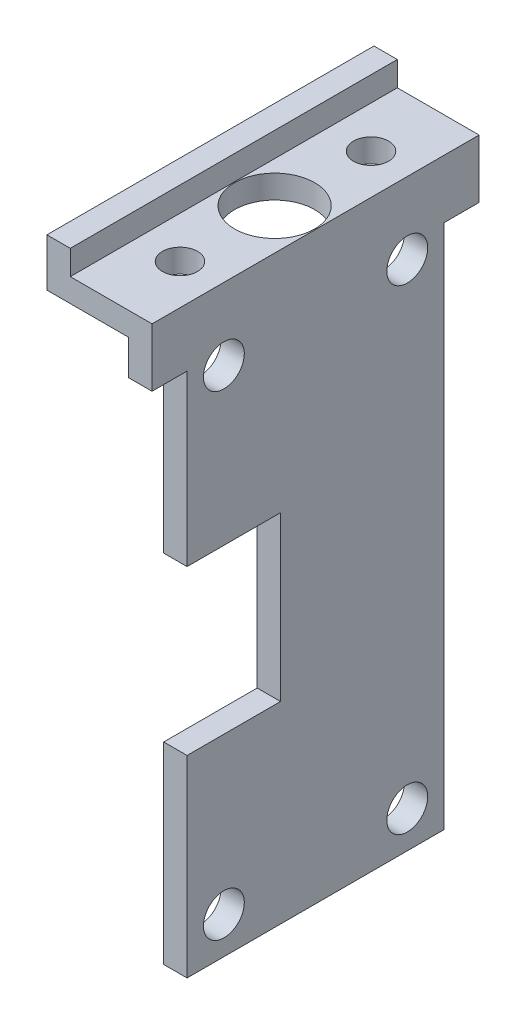
ISO-10303-21;
HEADER;
FILE_DESCRIPTION(('STEP AP214'),'2;1');
FILE_NAME('part.step','',(''),(''),'','','');
FILE_SCHEMA(('AUTOMOTIVE_DESIGN { 1 0 10303 214 1 1 1 1 }'));
ENDSEC;
DATA;
#1=APPLICATION_CONTEXT('core data for automotive mechanical design processes');
#2=APPLICATION_PROTOCOL_DEFINITION('international standard','automotive_design',2000,#1);
#3=PRODUCT_CONTEXT('',#1,'mechanical');
#4=PRODUCT('Part','Part','',(#3));
#5=PRODUCT_RELATED_PRODUCT_CATEGORY('part','',(#4));
#6=PRODUCT_DEFINITION_FORMATION('','',#4);
#7=PRODUCT_DEFINITION_CONTEXT('part definition',#1,'design');
#8=PRODUCT_DEFINITION('design','',#6,#7);
#9=PRODUCT_DEFINITION_SHAPE('','',#8);
#10=(LENGTH_UNIT() NAMED_UNIT(*) SI_UNIT(.MILLI.,.METRE.));
#11=(NAMED_UNIT(*) PLANE_ANGLE_UNIT() SI_UNIT($,.RADIAN.));
#12=(NAMED_UNIT(*) SI_UNIT($,.STERADIAN.) SOLID_ANGLE_UNIT());
#13=UNCERTAINTY_MEASURE_WITH_UNIT(LENGTH_MEASURE(1.E-05),#10,'distance_accuracy_value','');
#14=(GEOMETRIC_REPRESENTATION_CONTEXT(3) GLOBAL_UNCERTAINTY_ASSIGNED_CONTEXT((#13)) GLOBAL_UNIT_ASSIGNED_CONTEXT((#10,
#11,#12)) REPRESENTATION_CONTEXT('',''));
#15=CARTESIAN_POINT('',(0.,0.,0.));
#16=DIRECTION('',(0.,0.,1.));
#17=DIRECTION('',(1.,0.,0.));
#18=AXIS2_PLACEMENT_3D('',#15,#16,#17);
#19=CARTESIAN_POINT('',(-9.95317530410806,-0.412499999999998,25.));
#20=DIRECTION('',(0.,0.,-1.));
#21=DIRECTION('',(0.,1.,0.));
#22=AXIS2_PLACEMENT_3D('',#19,#20,#21);
#23=PLANE('',#22);
#24=DIRECTION('',(0.,1.,0.));
#25=VECTOR('',#24,1.);
#26=CARTESIAN_POINT('',(-9.95317530410806,-0.412499999999998,25.));
#27=LINE('',#26,#25);
#28=CARTESIAN_POINT('',(-9.95317530410806,-14.9125,25.));
#29=VERTEX_POINT('',#28);
#30=CARTESIAN_POINT('',(-9.95317530410806,-0.412499999999998,25.));
#31=VERTEX_POINT('',#30);
#32=EDGE_CURVE('E188',#29,#31,#27,.T.);
#33=ORIENTED_EDGE('',*,*,#32,.F.);
#34=DIRECTION('',(1.,0.,0.));
#35=VECTOR('',#34,1.);
#36=CARTESIAN_POINT('',(-9.95317530410806,-14.9125,25.));
#37=LINE('',#36,#35);
#38=CARTESIAN_POINT('',(-7.95317530410806,-14.9125,25.));
#39=VERTEX_POINT('',#38);
#40=EDGE_CURVE('E11',#29,#39,#37,.T.);
#41=ORIENTED_EDGE('',*,*,#40,.T.);
#42=DIRECTION('',(0.,1.,0.));
#43=VECTOR('',#42,1.);
#44=CARTESIAN_POINT('',(-7.95317530410806,-0.412499999999998,25.));
#45=LINE('',#44,#43);
#46=CARTESIAN_POINT('',(-7.95317530410806,-0.412499999999998,25.));
#47=VERTEX_POINT('',#46);
#48=EDGE_CURVE('E186',#39,#47,#45,.T.);
#49=ORIENTED_EDGE('',*,*,#48,.T.);
#50=DIRECTION('',(1.,0.,0.));
#51=VECTOR('',#50,1.);
#52=CARTESIAN_POINT('',(-9.95317530410806,-0.412499999999998,25.));
#53=LINE('',#52,#51);
#54=EDGE_CURVE('E199',#31,#47,#53,.T.);
#55=ORIENTED_EDGE('',*,*,#54,.F.);
#56=EDGE_LOOP('',(#33,#41,#49,#55));
#57=FACE_BOUND('',#56,.T.);
#58=ADVANCED_FACE('F33',(#57),#23,.F.);
#59=CARTESIAN_POINT('',(-16.9531753041081,2.5875,28.));
#60=DIRECTION('',(1.,0.,0.));
#61=DIRECTION('',(0.,0.,-1.));
#62=AXIS2_PLACEMENT_3D('',#59,#60,#61);
#63=PLANE('',#62);
#64=DIRECTION('',(0.,-1.,0.));
#65=VECTOR('',#64,1.);
#66=CARTESIAN_POINT('',(-16.9531753041081,2.5875,0.));
#67=LINE('',#66,#65);
#68=CARTESIAN_POINT('',(-16.9531753041081,6.6875,0.));
#69=VERTEX_POINT('',#68);
#70=CARTESIAN_POINT('',(-16.9531753041081,2.5875,0.));
#71=VERTEX_POINT('',#70);
#72=EDGE_CURVE('E217',#69,#71,#67,.T.);
#73=ORIENTED_EDGE('',*,*,#72,.T.);
#74=DIRECTION('',(0.,0.,-1.));
#75=VECTOR('',#74,1.);
#76=CARTESIAN_POINT('',(-16.9531753041081,2.5875,28.));
#77=LINE('',#76,#75);
#78=CARTESIAN_POINT('',(-16.9531753041081,2.5875,28.));
#79=VERTEX_POINT('',#78);
#80=EDGE_CURVE('E170',#79,#71,#77,.T.);
#81=ORIENTED_EDGE('',*,*,#80,.F.);
#82=DIRECTION('',(0.,-1.,0.));
#83=VECTOR('',#82,1.);
#84=CARTESIAN_POINT('',(-16.9531753041081,2.5875,28.));
#85=LINE('',#84,#83);
#86=CARTESIAN_POINT('',(-16.9531753041081,6.6875,28.));
#87=VERTEX_POINT('',#86);
#88=EDGE_CURVE('E221',#87,#79,#85,.T.);
#89=ORIENTED_EDGE('',*,*,#88,.F.);
#90=DIRECTION('',(0.,0.,-1.));
#91=VECTOR('',#90,1.);
#92=CARTESIAN_POINT('',(-16.9531753041081,6.6875,28.));
#93=LINE('',#92,#91);
#94=EDGE_CURVE('E238',#87,#69,#93,.T.);
#95=ORIENTED_EDGE('',*,*,#94,.T.);
#96=EDGE_LOOP('',(#73,#81,#89,#95));
#97=FACE_BOUND('',#96,.T.);
#98=ADVANCED_FACE('F35',(#97),#63,.F.);
#99=CARTESIAN_POINT('',(-9.95317530410806,2.5875,28.));
#100=DIRECTION('',(0.,1.,0.));
#101=DIRECTION('',(-1.,0.,0.));
#102=AXIS2_PLACEMENT_3D('',#99,#100,#101);
#103=PLANE('',#102);
#104=DIRECTION('',(0.,0.,-1.));
#105=VECTOR('',#104,1.);
#106=CARTESIAN_POINT('',(-9.95317530410806,2.5875,28.));
#107=LINE('',#106,#105);
#108=CARTESIAN_POINT('',(-9.95317530410806,2.5875,21.724774126454));
#109=VERTEX_POINT('',#108);
#110=CARTESIAN_POINT('',(-9.95317530410806,2.5875,17.0820654773948));
#111=VERTEX_POINT('',#110);
#112=EDGE_CURVE('E275',#109,#111,#107,.T.);
#113=ORIENTED_EDGE('',*,*,#112,.F.);
#114=CARTESIAN_POINT('',(-11.3831753041081,2.5875,22.1776538014229));
#115=DIRECTION('',(0.,1.,0.));
#116=DIRECTION('',(0.,0.,1.));
#117=AXIS2_PLACEMENT_3D('',#114,#115,#116);
#118=CIRCLE('',#117,1.5);
#119=CARTESIAN_POINT('',(-9.95317530410806,2.5875,22.6305334763919));
#120=VERTEX_POINT('',#119);
#121=EDGE_CURVE('E206',#109,#120,#118,.T.);
#122=ORIENTED_EDGE('',*,*,#121,.T.);
#123=CARTESIAN_POINT('',(-9.95317530410806,2.5875,28.));
#124=VERTEX_POINT('',#123);
#125=EDGE_CURVE('E271',#124,#120,#107,.T.);
#126=ORIENTED_EDGE('',*,*,#125,.F.);
#127=DIRECTION('',(1.,0.,0.));
#128=VECTOR('',#127,1.);
#129=CARTESIAN_POINT('',(-9.95317530410806,2.5875,28.));
#130=LINE('',#129,#128);
#131=EDGE_CURVE('E224',#79,#124,#130,.T.);
#132=ORIENTED_EDGE('',*,*,#131,.F.);
#133=ORIENTED_EDGE('',*,*,#80,.T.);
#134=DIRECTION('',(1.,0.,0.));
#135=VECTOR('',#134,1.);
#136=CARTESIAN_POINT('',(-9.95317530410806,2.5875,0.));
#137=LINE('',#136,#135);
#138=CARTESIAN_POINT('',(-9.95317530410806,2.5875,0.));
#139=VERTEX_POINT('',#138);
#140=EDGE_CURVE('E241',#71,#139,#137,.T.);
#141=ORIENTED_EDGE('',*,*,#140,.T.);
#142=CARTESIAN_POINT('',(-9.95317530410806,2.5875,5.36912032503104));
#143=VERTEX_POINT('',#142);
#144=EDGE_CURVE('E270',#143,#139,#107,.T.);
#145=ORIENTED_EDGE('',*,*,#144,.F.);
#146=CARTESIAN_POINT('',(-11.3831753041081,2.5875,5.822));
#147=DIRECTION('',(0.,1.,0.));
#148=DIRECTION('',(0.,0.,1.));
#149=AXIS2_PLACEMENT_3D('',#146,#147,#148);
#150=CIRCLE('',#149,1.5);
#151=CARTESIAN_POINT('',(-9.95317530410806,2.5875,6.27487967496896));
#152=VERTEX_POINT('',#151);
#153=EDGE_CURVE('E212',#143,#152,#150,.T.);
#154=ORIENTED_EDGE('',*,*,#153,.T.);
#155=CARTESIAN_POINT('',(-9.95317530410806,2.5875,10.9179345226052));
#156=VERTEX_POINT('',#155);
#157=EDGE_CURVE('E303',#156,#152,#107,.T.);
#158=ORIENTED_EDGE('',*,*,#157,.F.);
#159=CARTESIAN_POINT('',(-11.4584235869674,2.5875,14.));
#160=DIRECTION('',(0.,1.,0.));
#161=DIRECTION('',(0.,0.,1.));
#162=AXIS2_PLACEMENT_3D('',#159,#160,#161);
#163=CIRCLE('',#162,3.43);
#164=EDGE_CURVE('E218',#156,#111,#163,.T.);
#165=ORIENTED_EDGE('',*,*,#164,.T.);
#166=EDGE_LOOP('',(#113,#122,#126,#132,#133,#141,#145,#154,#158,#165));
#167=FACE_BOUND('',#166,.T.);
#168=ADVANCED_FACE('F281',(#167),#103,.F.);
#169=CARTESIAN_POINT('',(-9.95317530410805,-45.4125,28.));
#170=DIRECTION('',(1.,0.,0.));
#171=DIRECTION('',(0.,1.,0.));
#172=AXIS2_PLACEMENT_3D('',#169,#170,#171);
#173=PLANE('',#172);
#174=CARTESIAN_POINT('',(-9.95317530410806,-1.5625,21.8499999999998));
#175=DIRECTION('',(-1.,0.,0.));
#176=DIRECTION('',(0.,-1.,0.));
#177=AXIS2_PLACEMENT_3D('',#174,#175,#176);
#178=CIRCLE('',#177,1.75000000000063);
#179=CARTESIAN_POINT('',(-9.95317530410806,-3.31250000000063,21.8499999999998));
#180=VERTEX_POINT('',#179);
#181=EDGE_CURVE('E401',#180,#180,#178,.T.);
#182=ORIENTED_EDGE('',*,*,#181,.F.);
#183=EDGE_LOOP('',(#182));
#184=FACE_BOUND('',#183,.T.);
#185=CARTESIAN_POINT('',(-9.95317530410806,-1.5625,6.14999999999979));
#186=DIRECTION('',(-1.,0.,0.));
#187=DIRECTION('',(0.,-1.,0.));
#188=AXIS2_PLACEMENT_3D('',#185,#186,#187);
#189=CIRCLE('',#188,1.75000000000063);
#190=CARTESIAN_POINT('',(-9.95317530410806,-3.31250000000063,6.14999999999979));
#191=VERTEX_POINT('',#190);
#192=EDGE_CURVE('E405',#191,#191,#189,.T.);
#193=ORIENTED_EDGE('',*,*,#192,.F.);
#194=EDGE_LOOP('',(#193));
#195=FACE_BOUND('',#194,.T.);
#196=CARTESIAN_POINT('',(-9.95317530410805,-42.2625,6.15000000000001));
#197=DIRECTION('',(-1.,0.,0.));
#198=DIRECTION('',(0.,-1.,0.));
#199=AXIS2_PLACEMENT_3D('',#196,#197,#198);
#200=CIRCLE('',#199,1.75);
#201=CARTESIAN_POINT('',(-9.95317530410805,-44.0125,6.15000000000001));
#202=VERTEX_POINT('',#201);
#203=EDGE_CURVE('E411',#202,#202,#200,.T.);
#204=ORIENTED_EDGE('',*,*,#203,.F.);
#205=EDGE_LOOP('',(#204));
#206=FACE_BOUND('',#205,.T.);
#207=CARTESIAN_POINT('',(-9.95317530410805,-42.2625,21.85));
#208=DIRECTION('',(-1.,0.,0.));
#209=DIRECTION('',(0.,-1.,0.));
#210=AXIS2_PLACEMENT_3D('',#207,#208,#209);
#211=CIRCLE('',#210,1.75);
#212=CARTESIAN_POINT('',(-9.95317530410805,-44.0125,21.85));
#213=VERTEX_POINT('',#212);
#214=EDGE_CURVE('E417',#213,#213,#211,.T.);
#215=ORIENTED_EDGE('',*,*,#214,.F.);
#216=EDGE_LOOP('',(#215));
#217=FACE_BOUND('',#216,.T.);
#218=DIRECTION('',(0.,1.,0.));
#219=VECTOR('',#218,1.);
#220=CARTESIAN_POINT('',(-9.95317530410805,-45.4125,17.0000000000006));
#221=LINE('',#220,#219);
#222=CARTESIAN_POINT('',(-9.95317530410805,-28.9124999999999,17.0000000000006));
#223=VERTEX_POINT('',#222);
#224=CARTESIAN_POINT('',(-9.95317530410805,-14.9124999999999,17.0000000000006));
#225=VERTEX_POINT('',#224);
#226=EDGE_CURVE('E399',#223,#225,#221,.T.);
#227=ORIENTED_EDGE('',*,*,#226,.T.);
#228=DIRECTION('',(0.,0.,1.));
#229=VECTOR('',#228,1.);
#230=CARTESIAN_POINT('',(-9.95317530410805,-14.9125,28.0000000000002));
#231=LINE('',#230,#229);
#232=EDGE_CURVE('E389',#225,#29,#231,.T.);
#233=ORIENTED_EDGE('',*,*,#232,.T.);
#234=ORIENTED_EDGE('',*,*,#32,.T.);
#235=DIRECTION('',(0.,0.,1.));
#236=VECTOR('',#235,1.);
#237=CARTESIAN_POINT('',(-9.95317530410806,-0.412499999999998,28.));
#238=LINE('',#237,#236);
#239=CARTESIAN_POINT('',(-9.95317530410806,-0.412499999999998,28.));
#240=VERTEX_POINT('',#239);
#241=EDGE_CURVE('E192',#31,#240,#238,.T.);
#242=ORIENTED_EDGE('',*,*,#241,.T.);
#243=DIRECTION('',(0.,-1.,0.));
#244=VECTOR('',#243,1.);
#245=CARTESIAN_POINT('',(-9.95317530410805,-45.4125,28.));
#246=LINE('',#245,#244);
#247=EDGE_CURVE('E227',#124,#240,#246,.T.);
#248=ORIENTED_EDGE('',*,*,#247,.F.);
#249=ORIENTED_EDGE('',*,*,#125,.T.);
#250=EDGE_CURVE('E274',#120,#109,#107,.T.);
#251=ORIENTED_EDGE('',*,*,#250,.T.);
#252=ORIENTED_EDGE('',*,*,#112,.T.);
#253=EDGE_CURVE('E276',#111,#156,#107,.T.);
#254=ORIENTED_EDGE('',*,*,#253,.T.);
#255=ORIENTED_EDGE('',*,*,#157,.T.);
#256=EDGE_CURVE('E301',#152,#143,#107,.T.);
#257=ORIENTED_EDGE('',*,*,#256,.T.);
#258=ORIENTED_EDGE('',*,*,#144,.T.);
#259=DIRECTION('',(0.,-1.,0.));
#260=VECTOR('',#259,1.);
#261=CARTESIAN_POINT('',(-9.95317530410805,-45.4125,0.));
#262=LINE('',#261,#260);
#263=CARTESIAN_POINT('',(-9.95317530410806,-0.412499999999996,0.));
#264=VERTEX_POINT('',#263);
#265=EDGE_CURVE('E244',#139,#264,#262,.T.);
#266=ORIENTED_EDGE('',*,*,#265,.T.);
#267=DIRECTION('',(0.,0.,1.));
#268=VECTOR('',#267,1.);
#269=CARTESIAN_POINT('',(-9.95317530410806,-0.412499999999998,0.));
#270=LINE('',#269,#268);
#271=CARTESIAN_POINT('',(-9.95317530410806,-0.412499999999999,3.));
#272=VERTEX_POINT('',#271);
#273=EDGE_CURVE('E56',#264,#272,#270,.T.);
#274=ORIENTED_EDGE('',*,*,#273,.T.);
#275=DIRECTION('',(0.,-1.,0.));
#276=VECTOR('',#275,1.);
#277=CARTESIAN_POINT('',(-9.95317530410805,-45.4125,3.));
#278=LINE('',#277,#276);
#279=CARTESIAN_POINT('',(-9.95317530410805,-45.4125,3.));
#280=VERTEX_POINT('',#279);
#281=EDGE_CURVE('E427',#272,#280,#278,.T.);
#282=ORIENTED_EDGE('',*,*,#281,.T.);
#283=DIRECTION('',(0.,0.,-1.));
#284=VECTOR('',#283,1.);
#285=CARTESIAN_POINT('',(-9.95317530410805,-45.4125,28.));
#286=LINE('',#285,#284);
#287=CARTESIAN_POINT('',(-9.95317530410805,-45.4125,25.));
#288=VERTEX_POINT('',#287);
#289=EDGE_CURVE('E267',#288,#280,#286,.T.);
#290=ORIENTED_EDGE('',*,*,#289,.F.);
#291=CARTESIAN_POINT('',(-9.95317530410805,-28.9125,25.));
#292=VERTEX_POINT('',#291);
#293=EDGE_CURVE('E437',#288,#292,#27,.T.);
#294=ORIENTED_EDGE('',*,*,#293,.T.);
#295=DIRECTION('',(0.,0.,-1.));
#296=VECTOR('',#295,1.);
#297=CARTESIAN_POINT('',(-9.95317530410805,-28.9125,28.0000000000001));
#298=LINE('',#297,#296);
#299=EDGE_CURVE('E48',#292,#223,#298,.T.);
#300=ORIENTED_EDGE('',*,*,#299,.T.);
#301=EDGE_LOOP('',(#227,#233,#234,#242,#248,#249,#251,#252,#254,#255,#257,#258,#266,#274,#282,
#290,#294,#300));
#302=FACE_BOUND('',#301,.T.);
#303=ADVANCED_FACE('F297',(#184,#195,#206,#217,#302),#173,.F.);
#304=CARTESIAN_POINT('',(-7.95317530410805,-45.4125,28.));
#305=DIRECTION('',(0.,1.,0.));
#306=DIRECTION('',(0.,0.,1.));
#307=AXIS2_PLACEMENT_3D('',#304,#305,#306);
#308=PLANE('',#307);
#309=ORIENTED_EDGE('',*,*,#289,.T.);
#310=DIRECTION('',(1.,0.,0.));
#311=VECTOR('',#310,1.);
#312=CARTESIAN_POINT('',(-9.95317530410805,-45.4125,3.));
#313=LINE('',#312,#311);
#314=CARTESIAN_POINT('',(-7.95317530410805,-45.4125,3.));
#315=VERTEX_POINT('',#314);
#316=EDGE_CURVE('E190',#280,#315,#313,.T.);
#317=ORIENTED_EDGE('',*,*,#316,.T.);
#318=DIRECTION('',(0.,0.,-1.));
#319=VECTOR('',#318,1.);
#320=CARTESIAN_POINT('',(-7.95317530410805,-45.4125,28.));
#321=LINE('',#320,#319);
#322=CARTESIAN_POINT('',(-7.95317530410805,-45.4125,25.));
#323=VERTEX_POINT('',#322);
#324=EDGE_CURVE('E265',#323,#315,#321,.T.);
#325=ORIENTED_EDGE('',*,*,#324,.F.);
#326=DIRECTION('',(1.,0.,0.));
#327=VECTOR('',#326,1.);
#328=CARTESIAN_POINT('',(-9.95317530410805,-45.4125,25.));
#329=LINE('',#328,#327);
#330=EDGE_CURVE('E184',#288,#323,#329,.T.);
#331=ORIENTED_EDGE('',*,*,#330,.F.);
#332=EDGE_LOOP('',(#309,#317,#325,#331));
#333=FACE_BOUND('',#332,.T.);
#334=ADVANCED_FACE('F480',(#333),#308,.F.);
#335=CARTESIAN_POINT('',(-7.95317530410806,4.5875,28.));
#336=DIRECTION('',(-1.,0.,0.));
#337=DIRECTION('',(0.,-1.,0.));
#338=AXIS2_PLACEMENT_3D('',#335,#336,#337);
#339=PLANE('',#338);
#340=CARTESIAN_POINT('',(-7.95317530410805,-1.5625,21.8499999999998));
#341=DIRECTION('',(-1.,0.,0.));
#342=DIRECTION('',(0.,-1.,0.));
#343=AXIS2_PLACEMENT_3D('',#340,#341,#342);
#344=CIRCLE('',#343,1.75000000000063);
#345=CARTESIAN_POINT('',(-7.95317530410805,-3.31250000000063,21.8499999999998));
#346=VERTEX_POINT('',#345);
#347=EDGE_CURVE('E402',#346,#346,#344,.T.);
#348=ORIENTED_EDGE('',*,*,#347,.T.);
#349=EDGE_LOOP('',(#348));
#350=FACE_BOUND('',#349,.T.);
#351=CARTESIAN_POINT('',(-7.95317530410805,-1.5625,6.14999999999979));
#352=DIRECTION('',(-1.,0.,0.));
#353=DIRECTION('',(0.,-1.,0.));
#354=AXIS2_PLACEMENT_3D('',#351,#352,#353);
#355=CIRCLE('',#354,1.75000000000063);
#356=CARTESIAN_POINT('',(-7.95317530410805,-3.31250000000063,6.14999999999979));
#357=VERTEX_POINT('',#356);
#358=EDGE_CURVE('E408',#357,#357,#355,.T.);
#359=ORIENTED_EDGE('',*,*,#358,.T.);
#360=EDGE_LOOP('',(#359));
#361=FACE_BOUND('',#360,.T.);
#362=CARTESIAN_POINT('',(-7.95317530410805,-42.2625,6.15000000000001));
#363=DIRECTION('',(-1.,0.,0.));
#364=DIRECTION('',(0.,-1.,0.));
#365=AXIS2_PLACEMENT_3D('',#362,#363,#364);
#366=CIRCLE('',#365,1.75);
#367=CARTESIAN_POINT('',(-7.95317530410805,-44.0125,6.15000000000001));
#368=VERTEX_POINT('',#367);
#369=EDGE_CURVE('E414',#368,#368,#366,.T.);
#370=ORIENTED_EDGE('',*,*,#369,.T.);
#371=EDGE_LOOP('',(#370));
#372=FACE_BOUND('',#371,.T.);
#373=CARTESIAN_POINT('',(-7.95317530410805,-42.2625,21.85));
#374=DIRECTION('',(-1.,0.,0.));
#375=DIRECTION('',(0.,-1.,0.));
#376=AXIS2_PLACEMENT_3D('',#373,#374,#375);
#377=CIRCLE('',#376,1.75);
#378=CARTESIAN_POINT('',(-7.95317530410805,-44.0125,21.85));
#379=VERTEX_POINT('',#378);
#380=EDGE_CURVE('E420',#379,#379,#377,.T.);
#381=ORIENTED_EDGE('',*,*,#380,.T.);
#382=EDGE_LOOP('',(#381));
#383=FACE_BOUND('',#382,.T.);
#384=ORIENTED_EDGE('',*,*,#48,.F.);
#385=DIRECTION('',(0.,0.,1.));
#386=VECTOR('',#385,1.);
#387=CARTESIAN_POINT('',(-7.95317530410806,-14.9125,25.));
#388=LINE('',#387,#386);
#389=CARTESIAN_POINT('',(-7.95317530410806,-14.9124999999999,17.0000000000006));
#390=VERTEX_POINT('',#389);
#391=EDGE_CURVE('E387',#390,#39,#388,.T.);
#392=ORIENTED_EDGE('',*,*,#391,.F.);
#393=DIRECTION('',(0.,1.,0.));
#394=VECTOR('',#393,1.);
#395=CARTESIAN_POINT('',(-7.95317530410805,-28.9124999999999,17.0000000000006));
#396=LINE('',#395,#394);
#397=CARTESIAN_POINT('',(-7.95317530410805,-28.9124999999999,17.0000000000006));
#398=VERTEX_POINT('',#397);
#399=EDGE_CURVE('E180',#398,#390,#396,.T.);
#400=ORIENTED_EDGE('',*,*,#399,.F.);
#401=DIRECTION('',(0.,0.,-1.));
#402=VECTOR('',#401,1.);
#403=CARTESIAN_POINT('',(-7.95317530410805,-28.9125,25.));
#404=LINE('',#403,#402);
#405=CARTESIAN_POINT('',(-7.95317530410805,-28.9125,25.));
#406=VERTEX_POINT('',#405);
#407=EDGE_CURVE('E165',#406,#398,#404,.T.);
#408=ORIENTED_EDGE('',*,*,#407,.F.);
#409=EDGE_CURVE('E176',#323,#406,#45,.T.);
#410=ORIENTED_EDGE('',*,*,#409,.F.);
#411=ORIENTED_EDGE('',*,*,#324,.T.);
#412=DIRECTION('',(0.,-1.,0.));
#413=VECTOR('',#412,1.);
#414=CARTESIAN_POINT('',(-7.95317530410805,-45.4125,3.));
#415=LINE('',#414,#413);
#416=CARTESIAN_POINT('',(-7.95317530410806,-0.412499999999999,3.));
#417=VERTEX_POINT('',#416);
#418=EDGE_CURVE('E428',#417,#315,#415,.T.);
#419=ORIENTED_EDGE('',*,*,#418,.F.);
#420=DIRECTION('',(0.,0.,1.));
#421=VECTOR('',#420,1.);
#422=CARTESIAN_POINT('',(-7.95317530410806,-0.412499999999997,0.));
#423=LINE('',#422,#421);
#424=CARTESIAN_POINT('',(-7.95317530410806,-0.412499999999997,0.));
#425=VERTEX_POINT('',#424);
#426=EDGE_CURVE('E423',#425,#417,#423,.T.);
#427=ORIENTED_EDGE('',*,*,#426,.F.);
#428=DIRECTION('',(0.,1.,0.));
#429=VECTOR('',#428,1.);
#430=CARTESIAN_POINT('',(-7.95317530410806,4.5875,0.));
#431=LINE('',#430,#429);
#432=CARTESIAN_POINT('',(-7.95317530410806,4.5875,0.));
#433=VERTEX_POINT('',#432);
#434=EDGE_CURVE('E247',#425,#433,#431,.T.);
#435=ORIENTED_EDGE('',*,*,#434,.T.);
#436=DIRECTION('',(0.,0.,-1.));
#437=VECTOR('',#436,1.);
#438=CARTESIAN_POINT('',(-7.95317530410806,4.5875,28.));
#439=LINE('',#438,#437);
#440=CARTESIAN_POINT('',(-7.95317530410806,4.5875,28.));
#441=VERTEX_POINT('',#440);
#442=EDGE_CURVE('E262',#441,#433,#439,.T.);
#443=ORIENTED_EDGE('',*,*,#442,.F.);
#444=DIRECTION('',(0.,1.,0.));
#445=VECTOR('',#444,1.);
#446=CARTESIAN_POINT('',(-7.95317530410806,4.5875,28.));
#447=LINE('',#446,#445);
#448=CARTESIAN_POINT('',(-7.95317530410806,-0.412499999999998,28.));
#449=VERTEX_POINT('',#448);
#450=EDGE_CURVE('E230',#449,#441,#447,.T.);
#451=ORIENTED_EDGE('',*,*,#450,.F.);
#452=DIRECTION('',(0.,0.,1.));
#453=VECTOR('',#452,1.);
#454=CARTESIAN_POINT('',(-7.95317530410806,-0.412499999999998,28.));
#455=LINE('',#454,#453);
#456=EDGE_CURVE('E185',#47,#449,#455,.T.);
#457=ORIENTED_EDGE('',*,*,#456,.F.);
#458=EDGE_LOOP('',(#384,#392,#400,#408,#410,#411,#419,#427,#435,#443,#451,#457));
#459=FACE_BOUND('',#458,.T.);
#460=ADVANCED_FACE('F174',(#350,#361,#372,#383,#459),#339,.F.);
#461=CARTESIAN_POINT('',(-14.9531753041081,4.5875,28.));
#462=DIRECTION('',(0.,-1.,0.));
#463=DIRECTION('',(1.,0.,0.));
#464=AXIS2_PLACEMENT_3D('',#461,#462,#463);
#465=PLANE('',#464);
#466=CARTESIAN_POINT('',(-11.3831753041081,4.5875,22.1776538014229));
#467=DIRECTION('',(0.,1.,0.));
#468=DIRECTION('',(0.,0.,1.));
#469=AXIS2_PLACEMENT_3D('',#466,#467,#468);
#470=CIRCLE('',#469,1.5);
#471=CARTESIAN_POINT('',(-11.3831753041081,4.5875,23.6776538014229));
#472=VERTEX_POINT('',#471);
#473=EDGE_CURVE('E198',#472,#472,#470,.T.);
#474=ORIENTED_EDGE('',*,*,#473,.F.);
#475=EDGE_LOOP('',(#474));
#476=FACE_BOUND('',#475,.T.);
#477=CARTESIAN_POINT('',(-11.3831753041081,4.5875,5.822));
#478=DIRECTION('',(0.,1.,0.));
#479=DIRECTION('',(0.,0.,1.));
#480=AXIS2_PLACEMENT_3D('',#477,#478,#479);
#481=CIRCLE('',#480,1.5);
#482=CARTESIAN_POINT('',(-11.3831753041081,4.5875,7.322));
#483=VERTEX_POINT('',#482);
#484=EDGE_CURVE('E205',#483,#483,#481,.T.);
#485=ORIENTED_EDGE('',*,*,#484,.F.);
#486=EDGE_LOOP('',(#485));
#487=FACE_BOUND('',#486,.T.);
#488=CARTESIAN_POINT('',(-11.4584235869674,4.5875,14.));
#489=DIRECTION('',(0.,1.,0.));
#490=DIRECTION('',(0.,0.,1.));
#491=AXIS2_PLACEMENT_3D('',#488,#489,#490);
#492=CIRCLE('',#491,3.43);
#493=CARTESIAN_POINT('',(-11.4584235869674,4.5875,17.43));
#494=VERTEX_POINT('',#493);
#495=EDGE_CURVE('E211',#494,#494,#492,.T.);
#496=ORIENTED_EDGE('',*,*,#495,.F.);
#497=EDGE_LOOP('',(#496));
#498=FACE_BOUND('',#497,.T.);
#499=DIRECTION('',(-1.,0.,0.));
#500=VECTOR('',#499,1.);
#501=CARTESIAN_POINT('',(-14.9531753041081,4.5875,0.));
#502=LINE('',#501,#500);
#503=CARTESIAN_POINT('',(-14.9531753041081,4.5875,0.));
#504=VERTEX_POINT('',#503);
#505=EDGE_CURVE('E249',#433,#504,#502,.T.);
#506=ORIENTED_EDGE('',*,*,#505,.T.);
#507=DIRECTION('',(0.,0.,-1.));
#508=VECTOR('',#507,1.);
#509=CARTESIAN_POINT('',(-14.9531753041081,4.5875,28.));
#510=LINE('',#509,#508);
#511=CARTESIAN_POINT('',(-14.9531753041081,4.5875,28.));
#512=VERTEX_POINT('',#511);
#513=EDGE_CURVE('E259',#512,#504,#510,.T.);
#514=ORIENTED_EDGE('',*,*,#513,.F.);
#515=DIRECTION('',(-1.,0.,0.));
#516=VECTOR('',#515,1.);
#517=CARTESIAN_POINT('',(-14.9531753041081,4.5875,28.));
#518=LINE('',#517,#516);
#519=EDGE_CURVE('E232',#441,#512,#518,.T.);
#520=ORIENTED_EDGE('',*,*,#519,.F.);
#521=ORIENTED_EDGE('',*,*,#442,.T.);
#522=EDGE_LOOP('',(#506,#514,#520,#521));
#523=FACE_BOUND('',#522,.T.);
#524=ADVANCED_FACE('F452',(#476,#487,#498,#523),#465,.F.);
#525=CARTESIAN_POINT('',(-14.9531753041081,6.6875,28.));
#526=DIRECTION('',(-1.,0.,0.));
#527=DIRECTION('',(0.,-1.,0.));
#528=AXIS2_PLACEMENT_3D('',#525,#526,#527);
#529=PLANE('',#528);
#530=DIRECTION('',(0.,1.,0.));
#531=VECTOR('',#530,1.);
#532=CARTESIAN_POINT('',(-14.9531753041081,6.6875,0.));
#533=LINE('',#532,#531);
#534=CARTESIAN_POINT('',(-14.9531753041081,6.6875,0.));
#535=VERTEX_POINT('',#534);
#536=EDGE_CURVE('E251',#504,#535,#533,.T.);
#537=ORIENTED_EDGE('',*,*,#536,.T.);
#538=DIRECTION('',(0.,0.,-1.));
#539=VECTOR('',#538,1.);
#540=CARTESIAN_POINT('',(-14.9531753041081,6.6875,28.));
#541=LINE('',#540,#539);
#542=CARTESIAN_POINT('',(-14.9531753041081,6.6875,28.));
#543=VERTEX_POINT('',#542);
#544=EDGE_CURVE('E256',#543,#535,#541,.T.);
#545=ORIENTED_EDGE('',*,*,#544,.F.);
#546=DIRECTION('',(0.,1.,0.));
#547=VECTOR('',#546,1.);
#548=CARTESIAN_POINT('',(-14.9531753041081,6.6875,28.));
#549=LINE('',#548,#547);
#550=EDGE_CURVE('E234',#512,#543,#549,.T.);
#551=ORIENTED_EDGE('',*,*,#550,.F.);
#552=ORIENTED_EDGE('',*,*,#513,.T.);
#553=EDGE_LOOP('',(#537,#545,#551,#552));
#554=FACE_BOUND('',#553,.T.);
#555=ADVANCED_FACE('F457',(#554),#529,.F.);
#556=CARTESIAN_POINT('',(-16.9531753041081,6.6875,28.));
#557=DIRECTION('',(0.,-1.,0.));
#558=DIRECTION('',(1.,0.,0.));
#559=AXIS2_PLACEMENT_3D('',#556,#557,#558);
#560=PLANE('',#559);
#561=DIRECTION('',(-1.,0.,0.));
#562=VECTOR('',#561,1.);
#563=CARTESIAN_POINT('',(-16.9531753041081,6.6875,0.));
#564=LINE('',#563,#562);
#565=EDGE_CURVE('E225',#535,#69,#564,.T.);
#566=ORIENTED_EDGE('',*,*,#565,.T.);
#567=ORIENTED_EDGE('',*,*,#94,.F.);
#568=DIRECTION('',(-1.,0.,0.));
#569=VECTOR('',#568,1.);
#570=CARTESIAN_POINT('',(-16.9531753041081,6.6875,28.));
#571=LINE('',#570,#569);
#572=EDGE_CURVE('E236',#543,#87,#571,.T.);
#573=ORIENTED_EDGE('',*,*,#572,.F.);
#574=ORIENTED_EDGE('',*,*,#544,.T.);
#575=EDGE_LOOP('',(#566,#567,#573,#574));
#576=FACE_BOUND('',#575,.T.);
#577=ADVANCED_FACE('F459',(#576),#560,.F.);
#578=CARTESIAN_POINT('',(0.,0.,28.));
#579=DIRECTION('',(0.,0.,-1.));
#580=DIRECTION('',(-1.,0.,0.));
#581=AXIS2_PLACEMENT_3D('',#578,#579,#580);
#582=PLANE('',#581);
#583=ORIENTED_EDGE('',*,*,#247,.T.);
#584=DIRECTION('',(1.,0.,0.));
#585=VECTOR('',#584,1.);
#586=CARTESIAN_POINT('',(-9.95317530410806,-0.412499999999998,28.));
#587=LINE('',#586,#585);
#588=EDGE_CURVE('E195',#240,#449,#587,.T.);
#589=ORIENTED_EDGE('',*,*,#588,.T.);
#590=ORIENTED_EDGE('',*,*,#450,.T.);
#591=ORIENTED_EDGE('',*,*,#519,.T.);
#592=ORIENTED_EDGE('',*,*,#550,.T.);
#593=ORIENTED_EDGE('',*,*,#572,.T.);
#594=ORIENTED_EDGE('',*,*,#88,.T.);
#595=ORIENTED_EDGE('',*,*,#131,.T.);
#596=EDGE_LOOP('',(#583,#589,#590,#591,#592,#593,#594,#595));
#597=FACE_BOUND('',#596,.T.);
#598=ADVANCED_FACE('F445',(#597),#582,.F.);
#599=CARTESIAN_POINT('',(0.,0.,0.));
#600=DIRECTION('',(0.,0.,-1.));
#601=DIRECTION('',(-1.,0.,0.));
#602=AXIS2_PLACEMENT_3D('',#599,#600,#601);
#603=PLANE('',#602);
#604=DIRECTION('',(1.,0.,0.));
#605=VECTOR('',#604,1.);
#606=CARTESIAN_POINT('',(-9.95317530410806,-0.412499999999998,0.));
#607=LINE('',#606,#605);
#608=EDGE_CURVE('E294',#264,#425,#607,.T.);
#609=ORIENTED_EDGE('',*,*,#608,.F.);
#610=ORIENTED_EDGE('',*,*,#265,.F.);
#611=ORIENTED_EDGE('',*,*,#140,.F.);
#612=ORIENTED_EDGE('',*,*,#72,.F.);
#613=ORIENTED_EDGE('',*,*,#565,.F.);
#614=ORIENTED_EDGE('',*,*,#536,.F.);
#615=ORIENTED_EDGE('',*,*,#505,.F.);
#616=ORIENTED_EDGE('',*,*,#434,.F.);
#617=EDGE_LOOP('',(#609,#610,#611,#612,#613,#614,#615,#616));
#618=FACE_BOUND('',#617,.T.);
#619=ADVANCED_FACE('F291',(#618),#603,.T.);
#620=CARTESIAN_POINT('',(-11.4584235869674,2.5875,14.));
#621=DIRECTION('',(0.,1.,0.));
#622=DIRECTION('',(0.,0.,1.));
#623=AXIS2_PLACEMENT_3D('',#620,#621,#622);
#624=PLANE('',#623);
#625=ORIENTED_EDGE('',*,*,#253,.F.);
#626=EDGE_CURVE('E215',#111,#156,#163,.T.);
#627=ORIENTED_EDGE('',*,*,#626,.T.);
#628=EDGE_LOOP('',(#625,#627));
#629=FACE_BOUND('',#628,.T.);
#630=ADVANCED_FACE('F326',(#629),#624,.T.);
#631=CARTESIAN_POINT('',(-11.4584235869674,2.5875,14.));
#632=DIRECTION('',(0.,1.,0.));
#633=DIRECTION('',(0.,0.,1.));
#634=AXIS2_PLACEMENT_3D('',#631,#632,#633);
#635=CYLINDRICAL_SURFACE('',#634,3.43);
#636=ORIENTED_EDGE('',*,*,#626,.F.);
#637=ORIENTED_EDGE('',*,*,#164,.F.);
#638=EDGE_LOOP('',(#636,#637));
#639=FACE_BOUND('',#638,.T.);
#640=ORIENTED_EDGE('',*,*,#495,.T.);
#641=EDGE_LOOP('',(#640));
#642=FACE_BOUND('',#641,.T.);
#643=ADVANCED_FACE('F318',(#639,#642),#635,.F.);
#644=CARTESIAN_POINT('',(-11.3831753041081,2.5875,5.822));
#645=DIRECTION('',(0.,1.,0.));
#646=DIRECTION('',(0.,0.,1.));
#647=AXIS2_PLACEMENT_3D('',#644,#645,#646);
#648=PLANE('',#647);
#649=ORIENTED_EDGE('',*,*,#256,.F.);
#650=EDGE_CURVE('E209',#152,#143,#150,.T.);
#651=ORIENTED_EDGE('',*,*,#650,.T.);
#652=EDGE_LOOP('',(#649,#651));
#653=FACE_BOUND('',#652,.T.);
#654=ADVANCED_FACE('F316',(#653),#648,.T.);
#655=CARTESIAN_POINT('',(-11.3831753041081,2.5875,5.822));
#656=DIRECTION('',(0.,1.,0.));
#657=DIRECTION('',(0.,0.,1.));
#658=AXIS2_PLACEMENT_3D('',#655,#656,#657);
#659=CYLINDRICAL_SURFACE('',#658,1.5);
#660=ORIENTED_EDGE('',*,*,#650,.F.);
#661=ORIENTED_EDGE('',*,*,#153,.F.);
#662=EDGE_LOOP('',(#660,#661));
#663=FACE_BOUND('',#662,.T.);
#664=ORIENTED_EDGE('',*,*,#484,.T.);
#665=EDGE_LOOP('',(#664));
#666=FACE_BOUND('',#665,.T.);
#667=ADVANCED_FACE('F313',(#663,#666),#659,.F.);
#668=CARTESIAN_POINT('',(-11.3831753041081,2.5875,22.1776538014229));
#669=DIRECTION('',(0.,1.,0.));
#670=DIRECTION('',(0.,0.,1.));
#671=AXIS2_PLACEMENT_3D('',#668,#669,#670);
#672=PLANE('',#671);
#673=ORIENTED_EDGE('',*,*,#250,.F.);
#674=EDGE_CURVE('E203',#120,#109,#118,.T.);
#675=ORIENTED_EDGE('',*,*,#674,.T.);
#676=EDGE_LOOP('',(#673,#675));
#677=FACE_BOUND('',#676,.T.);
#678=ADVANCED_FACE('F324',(#677),#672,.T.);
#679=CARTESIAN_POINT('',(-11.3831753041081,2.5875,22.1776538014229));
#680=DIRECTION('',(0.,1.,0.));
#681=DIRECTION('',(0.,0.,1.));
#682=AXIS2_PLACEMENT_3D('',#679,#680,#681);
#683=CYLINDRICAL_SURFACE('',#682,1.5);
#684=ORIENTED_EDGE('',*,*,#674,.F.);
#685=ORIENTED_EDGE('',*,*,#121,.F.);
#686=EDGE_LOOP('',(#684,#685));
#687=FACE_BOUND('',#686,.T.);
#688=ORIENTED_EDGE('',*,*,#473,.T.);
#689=EDGE_LOOP('',(#688));
#690=FACE_BOUND('',#689,.T.);
#691=ADVANCED_FACE('F349',(#687,#690),#683,.F.);
#692=CARTESIAN_POINT('',(-9.95317530410806,-0.412499999999998,28.));
#693=DIRECTION('',(0.,1.,0.));
#694=DIRECTION('',(-1.,0.,0.));
#695=AXIS2_PLACEMENT_3D('',#692,#693,#694);
#696=PLANE('',#695);
#697=ORIENTED_EDGE('',*,*,#456,.T.);
#698=ORIENTED_EDGE('',*,*,#588,.F.);
#699=ORIENTED_EDGE('',*,*,#241,.F.);
#700=ORIENTED_EDGE('',*,*,#54,.T.);
#701=EDGE_LOOP('',(#697,#698,#699,#700));
#702=FACE_BOUND('',#701,.T.);
#703=ADVANCED_FACE('F341',(#702),#696,.F.);
#704=ORIENTED_EDGE('',*,*,#409,.T.);
#705=DIRECTION('',(-1.,0.,0.));
#706=VECTOR('',#705,1.);
#707=CARTESIAN_POINT('',(-9.95317530410805,-28.9125,25.));
#708=LINE('',#707,#706);
#709=EDGE_CURVE('E41',#406,#292,#708,.T.);
#710=ORIENTED_EDGE('',*,*,#709,.T.);
#711=ORIENTED_EDGE('',*,*,#293,.F.);
#712=ORIENTED_EDGE('',*,*,#330,.T.);
#713=EDGE_LOOP('',(#704,#710,#711,#712));
#714=FACE_BOUND('',#713,.T.);
#715=ADVANCED_FACE('F182',(#714),#23,.F.);
#716=CARTESIAN_POINT('',(-9.95317530410805,-45.4125,3.));
#717=DIRECTION('',(0.,0.,1.));
#718=DIRECTION('',(0.,-1.,0.));
#719=AXIS2_PLACEMENT_3D('',#716,#717,#718);
#720=PLANE('',#719);
#721=ORIENTED_EDGE('',*,*,#418,.T.);
#722=ORIENTED_EDGE('',*,*,#316,.F.);
#723=ORIENTED_EDGE('',*,*,#281,.F.);
#724=DIRECTION('',(1.,0.,0.));
#725=VECTOR('',#724,1.);
#726=CARTESIAN_POINT('',(-9.95317530410806,-0.412499999999999,3.));
#727=LINE('',#726,#725);
#728=EDGE_CURVE('E435',#272,#417,#727,.T.);
#729=ORIENTED_EDGE('',*,*,#728,.T.);
#730=EDGE_LOOP('',(#721,#722,#723,#729));
#731=FACE_BOUND('',#730,.T.);
#732=ADVANCED_FACE('F340',(#731),#720,.F.);
#733=CARTESIAN_POINT('',(-9.95317530410806,-0.412499999999998,0.));
#734=DIRECTION('',(0.,1.,0.));
#735=DIRECTION('',(0.,0.,1.));
#736=AXIS2_PLACEMENT_3D('',#733,#734,#735);
#737=PLANE('',#736);
#738=ORIENTED_EDGE('',*,*,#426,.T.);
#739=ORIENTED_EDGE('',*,*,#728,.F.);
#740=ORIENTED_EDGE('',*,*,#273,.F.);
#741=ORIENTED_EDGE('',*,*,#608,.T.);
#742=EDGE_LOOP('',(#738,#739,#740,#741));
#743=FACE_BOUND('',#742,.T.);
#744=ADVANCED_FACE('F346',(#743),#737,.F.);
#745=CARTESIAN_POINT('',(-7.95317530410805,-42.2625,21.85));
#746=DIRECTION('',(-1.,0.,0.));
#747=DIRECTION('',(0.,-1.,0.));
#748=AXIS2_PLACEMENT_3D('',#745,#746,#747);
#749=CYLINDRICAL_SURFACE('',#748,1.75);
#750=ORIENTED_EDGE('',*,*,#380,.F.);
#751=EDGE_LOOP('',(#750));
#752=FACE_BOUND('',#751,.T.);
#753=ORIENTED_EDGE('',*,*,#214,.T.);
#754=EDGE_LOOP('',(#753));
#755=FACE_BOUND('',#754,.T.);
#756=ADVANCED_FACE('F357',(#752,#755),#749,.F.);
#757=CARTESIAN_POINT('',(-7.95317530410805,-42.2625,6.15000000000001));
#758=DIRECTION('',(-1.,0.,0.));
#759=DIRECTION('',(0.,-1.,0.));
#760=AXIS2_PLACEMENT_3D('',#757,#758,#759);
#761=CYLINDRICAL_SURFACE('',#760,1.75);
#762=ORIENTED_EDGE('',*,*,#369,.F.);
#763=EDGE_LOOP('',(#762));
#764=FACE_BOUND('',#763,.T.);
#765=ORIENTED_EDGE('',*,*,#203,.T.);
#766=EDGE_LOOP('',(#765));
#767=FACE_BOUND('',#766,.T.);
#768=ADVANCED_FACE('F361',(#764,#767),#761,.F.);
#769=CARTESIAN_POINT('',(-7.95317530410805,-1.5625,6.14999999999979));
#770=DIRECTION('',(-1.,0.,0.));
#771=DIRECTION('',(0.,-1.,0.));
#772=AXIS2_PLACEMENT_3D('',#769,#770,#771);
#773=CYLINDRICAL_SURFACE('',#772,1.75000000000063);
#774=ORIENTED_EDGE('',*,*,#358,.F.);
#775=EDGE_LOOP('',(#774));
#776=FACE_BOUND('',#775,.T.);
#777=ORIENTED_EDGE('',*,*,#192,.T.);
#778=EDGE_LOOP('',(#777));
#779=FACE_BOUND('',#778,.T.);
#780=ADVANCED_FACE('F365',(#776,#779),#773,.F.);
#781=CARTESIAN_POINT('',(-7.95317530410805,-1.5625,21.8499999999998));
#782=DIRECTION('',(-1.,0.,0.));
#783=DIRECTION('',(0.,-1.,0.));
#784=AXIS2_PLACEMENT_3D('',#781,#782,#783);
#785=CYLINDRICAL_SURFACE('',#784,1.75000000000063);
#786=ORIENTED_EDGE('',*,*,#347,.F.);
#787=EDGE_LOOP('',(#786));
#788=FACE_BOUND('',#787,.T.);
#789=ORIENTED_EDGE('',*,*,#181,.T.);
#790=EDGE_LOOP('',(#789));
#791=FACE_BOUND('',#790,.T.);
#792=ADVANCED_FACE('F369',(#788,#791),#785,.F.);
#793=CARTESIAN_POINT('',(-16.9531753041081,-28.9124999999999,17.0000000000006));
#794=DIRECTION('',(0.,0.,-1.));
#795=DIRECTION('',(-1.,0.,0.));
#796=AXIS2_PLACEMENT_3D('',#793,#794,#795);
#797=PLANE('',#796);
#798=DIRECTION('',(1.,0.,0.));
#799=VECTOR('',#798,1.);
#800=CARTESIAN_POINT('',(-16.9531753041081,-28.9124999999999,17.0000000000006));
#801=LINE('',#800,#799);
#802=EDGE_CURVE('E390',#223,#398,#801,.T.);
#803=ORIENTED_EDGE('',*,*,#802,.T.);
#804=ORIENTED_EDGE('',*,*,#399,.T.);
#805=DIRECTION('',(1.,0.,0.));
#806=VECTOR('',#805,1.);
#807=CARTESIAN_POINT('',(-16.9531753041081,-14.9124999999999,17.0000000000006));
#808=LINE('',#807,#806);
#809=EDGE_CURVE('E386',#225,#390,#808,.T.);
#810=ORIENTED_EDGE('',*,*,#809,.F.);
#811=ORIENTED_EDGE('',*,*,#226,.F.);
#812=EDGE_LOOP('',(#803,#804,#810,#811));
#813=FACE_BOUND('',#812,.T.);
#814=ADVANCED_FACE('F373',(#813),#797,.F.);
#815=CARTESIAN_POINT('',(-16.9531753041081,-14.9125,25.));
#816=DIRECTION('',(0.,1.,0.));
#817=DIRECTION('',(0.,0.,1.));
#818=AXIS2_PLACEMENT_3D('',#815,#816,#817);
#819=PLANE('',#818);
#820=ORIENTED_EDGE('',*,*,#809,.T.);
#821=ORIENTED_EDGE('',*,*,#391,.T.);
#822=ORIENTED_EDGE('',*,*,#40,.F.);
#823=ORIENTED_EDGE('',*,*,#232,.F.);
#824=EDGE_LOOP('',(#820,#821,#822,#823));
#825=FACE_BOUND('',#824,.T.);
#826=ADVANCED_FACE('F377',(#825),#819,.F.);
#827=CARTESIAN_POINT('',(-16.9531753041081,-28.9125,25.));
#828=DIRECTION('',(0.,-1.,0.));
#829=DIRECTION('',(0.,0.,-1.));
#830=AXIS2_PLACEMENT_3D('',#827,#828,#829);
#831=PLANE('',#830);
#832=ORIENTED_EDGE('',*,*,#709,.F.);
#833=ORIENTED_EDGE('',*,*,#407,.T.);
#834=ORIENTED_EDGE('',*,*,#802,.F.);
#835=ORIENTED_EDGE('',*,*,#299,.F.);
#836=EDGE_LOOP('',(#832,#833,#834,#835));
#837=FACE_BOUND('',#836,.T.);
#838=ADVANCED_FACE('F164',(#837),#831,.F.);
#839=CLOSED_SHELL('',(#58,#98,#168,#303,#334,#460,#524,#555,#577,#598,#619,#630,#643,#654,#667,
#678,#691,#703,#715,#732,#744,#756,#768,#780,#792,#814,#826,#838));
#840=MANIFOLD_SOLID_BREP('B2',#839);
#841=ADVANCED_BREP_SHAPE_REPRESENTATION('',(#18,#840),#14);
#842=SHAPE_DEFINITION_REPRESENTATION(#9,#841);
ENDSEC;
END-ISO-10303-21;
